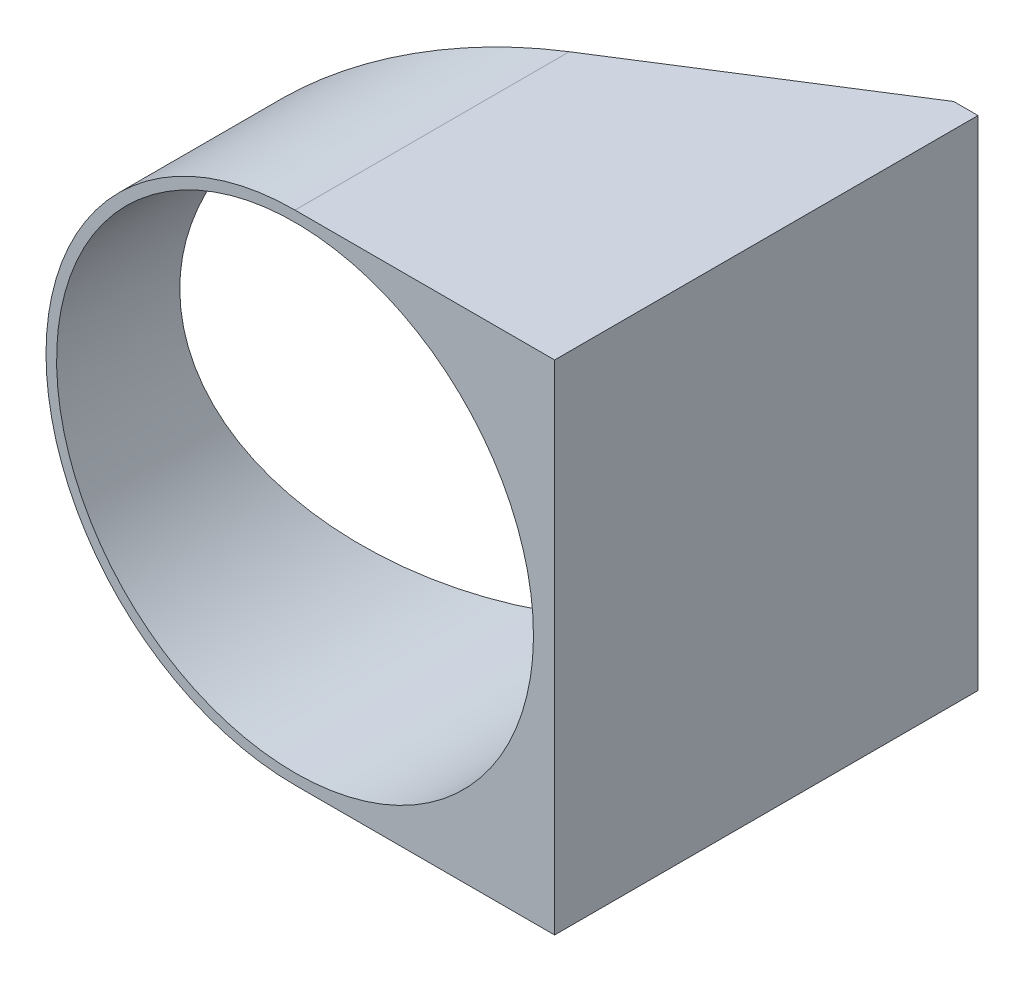
ISO-10303-21;
HEADER;
FILE_DESCRIPTION(('STEP AP214'),'2;1');
FILE_NAME('part.step','',(''),(''),'','','');
FILE_SCHEMA(('AUTOMOTIVE_DESIGN { 1 0 10303 214 1 1 1 1 }'));
ENDSEC;
DATA;
#1=APPLICATION_CONTEXT('core data for automotive mechanical design processes');
#2=APPLICATION_PROTOCOL_DEFINITION('international standard','automotive_design',2000,#1);
#3=PRODUCT_CONTEXT('',#1,'mechanical');
#4=PRODUCT('Part','Part','',(#3));
#5=PRODUCT_RELATED_PRODUCT_CATEGORY('part','',(#4));
#6=PRODUCT_DEFINITION_FORMATION('','',#4);
#7=PRODUCT_DEFINITION_CONTEXT('part definition',#1,'design');
#8=PRODUCT_DEFINITION('design','',#6,#7);
#9=PRODUCT_DEFINITION_SHAPE('','',#8);
#10=(LENGTH_UNIT() NAMED_UNIT(*) SI_UNIT(.MILLI.,.METRE.));
#11=(NAMED_UNIT(*) PLANE_ANGLE_UNIT() SI_UNIT($,.RADIAN.));
#12=(NAMED_UNIT(*) SI_UNIT($,.STERADIAN.) SOLID_ANGLE_UNIT());
#13=UNCERTAINTY_MEASURE_WITH_UNIT(LENGTH_MEASURE(1.E-05),#10,'distance_accuracy_value','');
#14=(GEOMETRIC_REPRESENTATION_CONTEXT(3) GLOBAL_UNCERTAINTY_ASSIGNED_CONTEXT((#13)) GLOBAL_UNIT_ASSIGNED_CONTEXT((#10,
#11,#12)) REPRESENTATION_CONTEXT('',''));
#15=CARTESIAN_POINT('',(0.,0.,0.));
#16=DIRECTION('',(0.,0.,1.));
#17=DIRECTION('',(1.,0.,0.));
#18=AXIS2_PLACEMENT_3D('',#15,#16,#17);
#19=CARTESIAN_POINT('',(443.127496956607,0.,-519.19274052214));
#20=DIRECTION('',(0.,0.,-1.));
#21=DIRECTION('',(-1.,0.,0.));
#22=AXIS2_PLACEMENT_3D('',#19,#20,#21);
#23=CYLINDRICAL_SURFACE('',#22,23.525);
#24=DIRECTION('',(0.,0.,1.));
#25=VECTOR('',#24,1.);
#26=CARTESIAN_POINT('',(443.127496956607,23.525,-559.19274052214));
#27=LINE('',#26,#25);
#28=CARTESIAN_POINT('',(443.127496956607,23.5250000000003,-545.106062963573));
#29=VERTEX_POINT('',#28);
#30=CARTESIAN_POINT('',(443.127496956608,23.525,-519.19274052214));
#31=VERTEX_POINT('',#30);
#32=EDGE_CURVE('E62',#29,#31,#27,.T.);
#33=ORIENTED_EDGE('',*,*,#32,.F.);
#34=CARTESIAN_POINT('',(443.127496956607,0.,-545.106062963573));
#35=DIRECTION('',(0.535346187403036,0.,0.844632736538807));
#36=DIRECTION('',(0.844632736538807,0.,-0.535346187403036));
#37=AXIS2_PLACEMENT_3D('',#34,#35,#36);
#38=ELLIPSE('',#37,27.8523421865015,23.525);
#39=CARTESIAN_POINT('',(443.127496956607,-23.5250000000001,-545.106062963573));
#40=VERTEX_POINT('',#39);
#41=EDGE_CURVE('E56',#29,#40,#38,.T.);
#42=ORIENTED_EDGE('',*,*,#41,.T.);
#43=DIRECTION('',(0.,0.,1.));
#44=VECTOR('',#43,1.);
#45=CARTESIAN_POINT('',(443.127496956607,-23.5250000000001,-559.19274052214));
#46=LINE('',#45,#44);
#47=CARTESIAN_POINT('',(443.127496956607,-23.5250000000001,-519.19274052214));
#48=VERTEX_POINT('',#47);
#49=EDGE_CURVE('E128',#40,#48,#46,.T.);
#50=ORIENTED_EDGE('',*,*,#49,.T.);
#51=CARTESIAN_POINT('',(443.127496956607,0.,-519.19274052214));
#52=DIRECTION('',(0.,0.,1.));
#53=DIRECTION('',(1.,0.,0.));
#54=AXIS2_PLACEMENT_3D('',#51,#52,#53);
#55=CIRCLE('',#54,23.525);
#56=EDGE_CURVE('E49',#31,#48,#55,.T.);
#57=ORIENTED_EDGE('',*,*,#56,.F.);
#58=EDGE_LOOP('',(#33,#42,#50,#57));
#59=FACE_BOUND('',#58,.T.);
#60=ADVANCED_FACE('F42',(#59),#23,.T.);
#61=CARTESIAN_POINT('',(443.127496956607,0.,-519.19274052214));
#62=DIRECTION('',(0.,0.,1.));
#63=DIRECTION('',(1.,0.,0.));
#64=AXIS2_PLACEMENT_3D('',#61,#62,#63);
#65=PLANE('',#64);
#66=ORIENTED_EDGE('',*,*,#56,.T.);
#67=DIRECTION('',(1.,0.,0.));
#68=VECTOR('',#67,1.);
#69=CARTESIAN_POINT('',(5.71331176813238E-13,-23.5250000000114,-519.19274052214));
#70=LINE('',#69,#68);
#71=CARTESIAN_POINT('',(467.652496956607,-23.525,-519.19274052214));
#72=VERTEX_POINT('',#71);
#73=EDGE_CURVE('E120',#48,#72,#70,.T.);
#74=ORIENTED_EDGE('',*,*,#73,.T.);
#75=DIRECTION('',(0.,1.,0.));
#76=VECTOR('',#75,1.);
#77=CARTESIAN_POINT('',(467.652496956607,0.,-519.19274052214));
#78=LINE('',#77,#76);
#79=CARTESIAN_POINT('',(467.652496956607,23.5249999999999,-519.19274052214));
#80=VERTEX_POINT('',#79);
#81=EDGE_CURVE('E123',#72,#80,#78,.T.);
#82=ORIENTED_EDGE('',*,*,#81,.T.);
#83=DIRECTION('',(1.,0.,0.));
#84=VECTOR('',#83,1.);
#85=CARTESIAN_POINT('',(6.52949916358028E-13,23.5250000000129,-519.19274052214));
#86=LINE('',#85,#84);
#87=EDGE_CURVE('E126',#31,#80,#86,.T.);
#88=ORIENTED_EDGE('',*,*,#87,.F.);
#89=EDGE_LOOP('',(#66,#74,#82,#88));
#90=FACE_BOUND('',#89,.T.);
#91=CARTESIAN_POINT('',(443.127496956607,0.,-519.19274052214));
#92=DIRECTION('',(0.,0.,1.));
#93=DIRECTION('',(1.,0.,0.));
#94=AXIS2_PLACEMENT_3D('',#91,#92,#93);
#95=CIRCLE('',#94,22.525);
#96=CARTESIAN_POINT('',(465.652496956607,0.,-519.19274052214));
#97=VERTEX_POINT('',#96);
#98=EDGE_CURVE('E132',#97,#97,#95,.T.);
#99=ORIENTED_EDGE('',*,*,#98,.F.);
#100=EDGE_LOOP('',(#99));
#101=FACE_BOUND('',#100,.T.);
#102=ADVANCED_FACE('F138',(#90,#101),#65,.T.);
#103=CARTESIAN_POINT('',(443.127496956607,0.,-559.19274052214));
#104=DIRECTION('',(0.,0.,1.));
#105=DIRECTION('',(1.,0.,0.));
#106=AXIS2_PLACEMENT_3D('',#103,#104,#105);
#107=PLANE('',#106);
#108=DIRECTION('',(1.,0.,0.));
#109=VECTOR('',#108,1.);
#110=CARTESIAN_POINT('',(5.71331176813238E-13,-23.5250000000114,-559.19274052214));
#111=LINE('',#110,#109);
#112=CARTESIAN_POINT('',(465.352496956607,-23.5250000000001,-559.19274052214));
#113=VERTEX_POINT('',#112);
#114=CARTESIAN_POINT('',(467.652496956607,-23.525,-559.19274052214));
#115=VERTEX_POINT('',#114);
#116=EDGE_CURVE('E116',#113,#115,#111,.T.);
#117=ORIENTED_EDGE('',*,*,#116,.F.);
#118=DIRECTION('',(0.,1.,0.));
#119=VECTOR('',#118,1.);
#120=CARTESIAN_POINT('',(465.352496956607,-23.5250000000001,-559.19274052214));
#121=LINE('',#120,#119);
#122=CARTESIAN_POINT('',(465.352496956607,-3.66401419211289,-559.19274052214));
#123=VERTEX_POINT('',#122);
#124=EDGE_CURVE('E106',#113,#123,#121,.T.);
#125=ORIENTED_EDGE('',*,*,#124,.T.);
#126=CARTESIAN_POINT('',(443.127496956607,0.,-559.19274052214));
#127=DIRECTION('',(0.,0.,1.));
#128=DIRECTION('',(1.,0.,0.));
#129=AXIS2_PLACEMENT_3D('',#126,#127,#128);
#130=CIRCLE('',#129,22.525);
#131=CARTESIAN_POINT('',(465.352496956607,3.66401419211278,-559.19274052214));
#132=VERTEX_POINT('',#131);
#133=EDGE_CURVE('E105',#123,#132,#130,.T.);
#134=ORIENTED_EDGE('',*,*,#133,.T.);
#135=CARTESIAN_POINT('',(465.352496956607,23.525,-559.19274052214));
#136=VERTEX_POINT('',#135);
#137=EDGE_CURVE('E93',#132,#136,#121,.T.);
#138=ORIENTED_EDGE('',*,*,#137,.T.);
#139=DIRECTION('',(1.,0.,0.));
#140=VECTOR('',#139,1.);
#141=CARTESIAN_POINT('',(6.52949916358028E-13,23.5250000000129,-559.19274052214));
#142=LINE('',#141,#140);
#143=CARTESIAN_POINT('',(467.652496956607,23.5249999999999,-559.19274052214));
#144=VERTEX_POINT('',#143);
#145=EDGE_CURVE('E101',#136,#144,#142,.T.);
#146=ORIENTED_EDGE('',*,*,#145,.T.);
#147=DIRECTION('',(0.,1.,0.));
#148=VECTOR('',#147,1.);
#149=CARTESIAN_POINT('',(467.652496956607,0.,-559.19274052214));
#150=LINE('',#149,#148);
#151=EDGE_CURVE('E113',#115,#144,#150,.T.);
#152=ORIENTED_EDGE('',*,*,#151,.F.);
#153=EDGE_LOOP('',(#117,#125,#134,#138,#146,#152));
#154=FACE_BOUND('',#153,.T.);
#155=ADVANCED_FACE('F99',(#154),#107,.F.);
#156=CARTESIAN_POINT('',(443.127496956607,0.,-519.19274052214));
#157=DIRECTION('',(0.,0.,-1.));
#158=DIRECTION('',(-1.,0.,0.));
#159=AXIS2_PLACEMENT_3D('',#156,#157,#158);
#160=CYLINDRICAL_SURFACE('',#159,22.525);
#161=CARTESIAN_POINT('',(443.127496956607,0.,-545.106062963573));
#162=DIRECTION('',(0.535346187403036,0.,0.844632736538807));
#163=DIRECTION('',(0.844632736538807,0.,-0.535346187403036));
#164=AXIS2_PLACEMENT_3D('',#161,#162,#163);
#165=ELLIPSE('',#164,26.6683956536003,22.525);
#166=EDGE_CURVE('E152',#132,#123,#165,.T.);
#167=ORIENTED_EDGE('',*,*,#166,.F.);
#168=ORIENTED_EDGE('',*,*,#133,.F.);
#169=EDGE_LOOP('',(#167,#168));
#170=FACE_BOUND('',#169,.T.);
#171=ORIENTED_EDGE('',*,*,#98,.T.);
#172=EDGE_LOOP('',(#171));
#173=FACE_BOUND('',#172,.T.);
#174=ADVANCED_FACE('F155',(#170,#173),#160,.F.);
#175=CARTESIAN_POINT('',(5.71331176813238E-13,-23.5250000000114,-559.19274052214));
#176=DIRECTION('',(0.,-1.,0.));
#177=DIRECTION('',(1.,0.,0.));
#178=AXIS2_PLACEMENT_3D('',#175,#176,#177);
#179=PLANE('',#178);
#180=DIRECTION('',(0.844632736538807,0.,-0.535346187403036));
#181=VECTOR('',#180,1.);
#182=CARTESIAN_POINT('',(419.602496956607,-23.5250000000001,-530.195417763785));
#183=LINE('',#182,#181);
#184=EDGE_CURVE('E107',#40,#113,#183,.T.);
#185=ORIENTED_EDGE('',*,*,#184,.T.);
#186=ORIENTED_EDGE('',*,*,#116,.T.);
#187=DIRECTION('',(0.,0.,1.));
#188=VECTOR('',#187,1.);
#189=CARTESIAN_POINT('',(467.652496956607,-23.525,-559.19274052214));
#190=LINE('',#189,#188);
#191=EDGE_CURVE('E112',#115,#72,#190,.T.);
#192=ORIENTED_EDGE('',*,*,#191,.T.);
#193=ORIENTED_EDGE('',*,*,#73,.F.);
#194=ORIENTED_EDGE('',*,*,#49,.F.);
#195=EDGE_LOOP('',(#185,#186,#192,#193,#194));
#196=FACE_BOUND('',#195,.T.);
#197=ADVANCED_FACE('F145',(#196),#179,.T.);
#198=CARTESIAN_POINT('',(6.52949916358028E-13,23.5250000000129,-559.19274052214));
#199=DIRECTION('',(0.,-1.,0.));
#200=DIRECTION('',(1.,0.,0.));
#201=AXIS2_PLACEMENT_3D('',#198,#199,#200);
#202=PLANE('',#201);
#203=ORIENTED_EDGE('',*,*,#145,.F.);
#204=DIRECTION('',(-0.844632736538807,0.,0.535346187403036));
#205=VECTOR('',#204,1.);
#206=CARTESIAN_POINT('',(133.367950326396,23.5250000000092,-348.773876053888));
#207=LINE('',#206,#205);
#208=EDGE_CURVE('E12',#136,#29,#207,.T.);
#209=ORIENTED_EDGE('',*,*,#208,.T.);
#210=ORIENTED_EDGE('',*,*,#32,.T.);
#211=ORIENTED_EDGE('',*,*,#87,.T.);
#212=DIRECTION('',(0.,0.,1.));
#213=VECTOR('',#212,1.);
#214=CARTESIAN_POINT('',(467.652496956607,23.5249999999999,-559.19274052214));
#215=LINE('',#214,#213);
#216=EDGE_CURVE('E110',#144,#80,#215,.T.);
#217=ORIENTED_EDGE('',*,*,#216,.F.);
#218=EDGE_LOOP('',(#203,#209,#210,#211,#217));
#219=FACE_BOUND('',#218,.T.);
#220=ADVANCED_FACE('F109',(#219),#202,.F.);
#221=CARTESIAN_POINT('',(467.652496956607,0.,-559.19274052214));
#222=DIRECTION('',(1.,0.,0.));
#223=DIRECTION('',(0.,0.,-1.));
#224=AXIS2_PLACEMENT_3D('',#221,#222,#223);
#225=PLANE('',#224);
#226=ORIENTED_EDGE('',*,*,#81,.F.);
#227=ORIENTED_EDGE('',*,*,#191,.F.);
#228=ORIENTED_EDGE('',*,*,#151,.T.);
#229=ORIENTED_EDGE('',*,*,#216,.T.);
#230=EDGE_LOOP('',(#226,#227,#228,#229));
#231=FACE_BOUND('',#230,.T.);
#232=ADVANCED_FACE('F149',(#231),#225,.T.);
#233=CARTESIAN_POINT('',(419.602496956607,-23.5250000000001,-530.195417763785));
#234=DIRECTION('',(0.535346187403036,0.,0.844632736538807));
#235=DIRECTION('',(0.844632736538807,0.,-0.535346187403036));
#236=AXIS2_PLACEMENT_3D('',#233,#234,#235);
#237=PLANE('',#236);
#238=ORIENTED_EDGE('',*,*,#208,.F.);
#239=ORIENTED_EDGE('',*,*,#137,.F.);
#240=ORIENTED_EDGE('',*,*,#166,.T.);
#241=ORIENTED_EDGE('',*,*,#124,.F.);
#242=ORIENTED_EDGE('',*,*,#184,.F.);
#243=ORIENTED_EDGE('',*,*,#41,.F.);
#244=EDGE_LOOP('',(#238,#239,#240,#241,#242,#243));
#245=FACE_BOUND('',#244,.T.);
#246=ADVANCED_FACE('F92',(#245),#237,.F.);
#247=CLOSED_SHELL('',(#60,#102,#155,#174,#197,#220,#232,#246));
#248=MANIFOLD_SOLID_BREP('B2',#247);
#249=ADVANCED_BREP_SHAPE_REPRESENTATION('',(#18,#248),#14);
#250=SHAPE_DEFINITION_REPRESENTATION(#9,#249);
ENDSEC;
END-ISO-10303-21;
